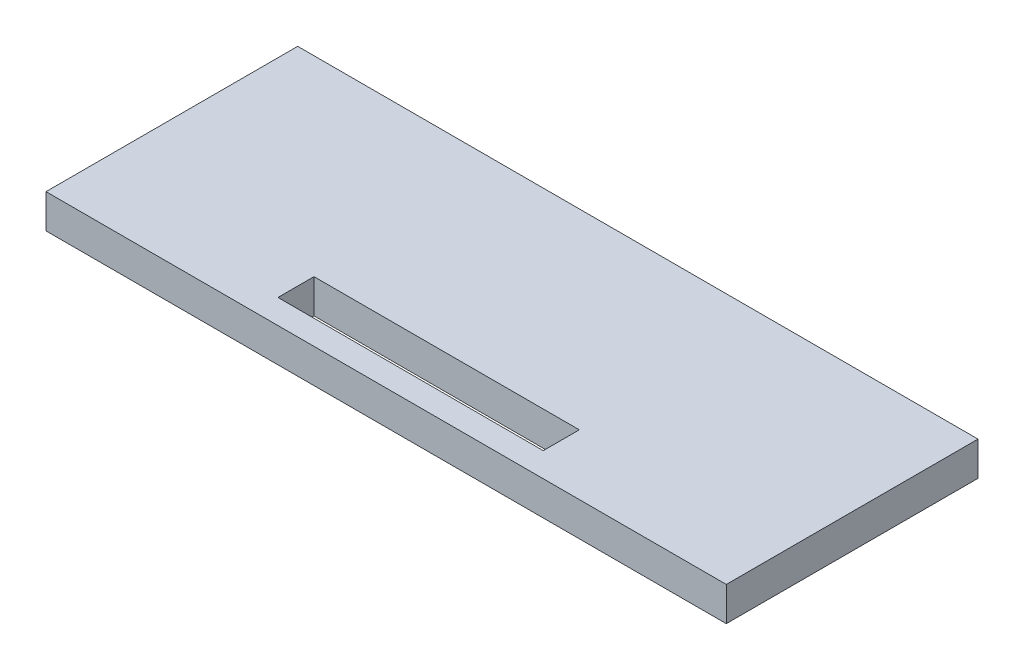
ISO-10303-21;
HEADER;
FILE_DESCRIPTION(('STEP AP214'),'2;1');
FILE_NAME('part.step','',(''),(''),'','','');
FILE_SCHEMA(('AUTOMOTIVE_DESIGN { 1 0 10303 214 1 1 1 1 }'));
ENDSEC;
DATA;
#1=APPLICATION_CONTEXT('core data for automotive mechanical design processes');
#2=APPLICATION_PROTOCOL_DEFINITION('international standard','automotive_design',2000,#1);
#3=PRODUCT_CONTEXT('',#1,'mechanical');
#4=PRODUCT('Part','Part','',(#3));
#5=PRODUCT_RELATED_PRODUCT_CATEGORY('part','',(#4));
#6=PRODUCT_DEFINITION_FORMATION('','',#4);
#7=PRODUCT_DEFINITION_CONTEXT('part definition',#1,'design');
#8=PRODUCT_DEFINITION('design','',#6,#7);
#9=PRODUCT_DEFINITION_SHAPE('','',#8);
#10=(LENGTH_UNIT() NAMED_UNIT(*) SI_UNIT(.MILLI.,.METRE.));
#11=(NAMED_UNIT(*) PLANE_ANGLE_UNIT() SI_UNIT($,.RADIAN.));
#12=(NAMED_UNIT(*) SI_UNIT($,.STERADIAN.) SOLID_ANGLE_UNIT());
#13=UNCERTAINTY_MEASURE_WITH_UNIT(LENGTH_MEASURE(1.E-05),#10,'distance_accuracy_value','');
#14=(GEOMETRIC_REPRESENTATION_CONTEXT(3) GLOBAL_UNCERTAINTY_ASSIGNED_CONTEXT((#13)) GLOBAL_UNIT_ASSIGNED_CONTEXT((#10,
#11,#12)) REPRESENTATION_CONTEXT('',''));
#15=CARTESIAN_POINT('',(0.,0.,0.));
#16=DIRECTION('',(0.,0.,1.));
#17=DIRECTION('',(1.,0.,0.));
#18=AXIS2_PLACEMENT_3D('',#15,#16,#17);
#19=CARTESIAN_POINT('',(0.,0.,0.));
#20=DIRECTION('',(0.,0.,-1.));
#21=DIRECTION('',(-1.,0.,0.));
#22=AXIS2_PLACEMENT_3D('',#19,#20,#21);
#23=PLANE('',#22);
#24=DIRECTION('',(-1.,0.,0.));
#25=VECTOR('',#24,1.);
#26=CARTESIAN_POINT('',(-50.0474551367422,-86.5025403784467,0.));
#27=LINE('',#26,#25);
#28=CARTESIAN_POINT('',(49.9525448632578,-86.5025403784467,0.));
#29=VERTEX_POINT('',#28);
#30=CARTESIAN_POINT('',(-50.0474551367422,-86.5025403784467,0.));
#31=VERTEX_POINT('',#30);
#32=EDGE_CURVE('E148',#29,#31,#27,.T.);
#33=ORIENTED_EDGE('',*,*,#32,.F.);
#34=DIRECTION('',(0.,1.,0.));
#35=VECTOR('',#34,1.);
#36=CARTESIAN_POINT('',(49.9525448632578,-86.5025403784467,0.));
#37=LINE('',#36,#35);
#38=CARTESIAN_POINT('',(49.9525448632578,-91.5025403784467,0.));
#39=VERTEX_POINT('',#38);
#40=EDGE_CURVE('E155',#39,#29,#37,.T.);
#41=ORIENTED_EDGE('',*,*,#40,.F.);
#42=DIRECTION('',(1.,0.,0.));
#43=VECTOR('',#42,1.);
#44=CARTESIAN_POINT('',(-50.0474551367422,-91.5025403784467,0.));
#45=LINE('',#44,#43);
#46=CARTESIAN_POINT('',(-50.0474551367422,-91.5025403784467,0.));
#47=VERTEX_POINT('',#46);
#48=EDGE_CURVE('E136',#47,#39,#45,.T.);
#49=ORIENTED_EDGE('',*,*,#48,.F.);
#50=DIRECTION('',(0.,-1.,0.));
#51=VECTOR('',#50,1.);
#52=CARTESIAN_POINT('',(-50.0474551367422,-90.5025403784467,0.));
#53=LINE('',#52,#51);
#54=EDGE_CURVE('E153',#31,#47,#53,.T.);
#55=ORIENTED_EDGE('',*,*,#54,.F.);
#56=EDGE_LOOP('',(#33,#41,#49,#55));
#57=FACE_BOUND('',#56,.T.);
#58=ADVANCED_FACE('F32',(#57),#23,.T.);
#59=CARTESIAN_POINT('',(49.9525448632578,-86.5025403784467,137.079968025574));
#60=DIRECTION('',(-1.,0.,0.));
#61=DIRECTION('',(0.,0.,1.));
#62=AXIS2_PLACEMENT_3D('',#59,#60,#61);
#63=PLANE('',#62);
#64=DIRECTION('',(0.,0.,-1.));
#65=VECTOR('',#64,1.);
#66=CARTESIAN_POINT('',(49.9525448632578,-86.5025403784467,137.079968025574));
#67=LINE('',#66,#65);
#68=CARTESIAN_POINT('',(49.9525448632578,-86.5025403784467,37.));
#69=VERTEX_POINT('',#68);
#70=EDGE_CURVE('E158',#69,#29,#67,.T.);
#71=ORIENTED_EDGE('',*,*,#70,.F.);
#72=DIRECTION('',(0.,-1.,0.));
#73=VECTOR('',#72,1.);
#74=CARTESIAN_POINT('',(49.9525448632578,-86.5025403784467,37.));
#75=LINE('',#74,#73);
#76=CARTESIAN_POINT('',(49.9525448632578,-91.5025403784467,37.));
#77=VERTEX_POINT('',#76);
#78=EDGE_CURVE('E36',#69,#77,#75,.T.);
#79=ORIENTED_EDGE('',*,*,#78,.T.);
#80=DIRECTION('',(0.,0.,1.));
#81=VECTOR('',#80,1.);
#82=CARTESIAN_POINT('',(49.9525448632578,-91.5025403784467,0.));
#83=LINE('',#82,#81);
#84=EDGE_CURVE('E139',#39,#77,#83,.T.);
#85=ORIENTED_EDGE('',*,*,#84,.F.);
#86=ORIENTED_EDGE('',*,*,#40,.T.);
#87=EDGE_LOOP('',(#71,#79,#85,#86));
#88=FACE_BOUND('',#87,.T.);
#89=ADVANCED_FACE('F166',(#88),#63,.F.);
#90=CARTESIAN_POINT('',(-50.0474551367422,-90.5025403784467,137.079968025574));
#91=DIRECTION('',(1.,0.,0.));
#92=DIRECTION('',(0.,0.,-1.));
#93=AXIS2_PLACEMENT_3D('',#90,#91,#92);
#94=PLANE('',#93);
#95=ORIENTED_EDGE('',*,*,#54,.T.);
#96=DIRECTION('',(0.,0.,-1.));
#97=VECTOR('',#96,1.);
#98=CARTESIAN_POINT('',(-50.0474551367422,-91.5025403784467,37.));
#99=LINE('',#98,#97);
#100=CARTESIAN_POINT('',(-50.0474551367422,-91.5025403784467,37.));
#101=VERTEX_POINT('',#100);
#102=EDGE_CURVE('E145',#101,#47,#99,.T.);
#103=ORIENTED_EDGE('',*,*,#102,.F.);
#104=DIRECTION('',(0.,1.,0.));
#105=VECTOR('',#104,1.);
#106=CARTESIAN_POINT('',(-50.0474551367422,-90.5025403784467,37.));
#107=LINE('',#106,#105);
#108=CARTESIAN_POINT('',(-50.0474551367422,-86.5025403784467,37.));
#109=VERTEX_POINT('',#108);
#110=EDGE_CURVE('E41',#101,#109,#107,.T.);
#111=ORIENTED_EDGE('',*,*,#110,.T.);
#112=DIRECTION('',(0.,0.,-1.));
#113=VECTOR('',#112,1.);
#114=CARTESIAN_POINT('',(-50.0474551367422,-86.5025403784467,137.079968025574));
#115=LINE('',#114,#113);
#116=EDGE_CURVE('E159',#109,#31,#115,.T.);
#117=ORIENTED_EDGE('',*,*,#116,.T.);
#118=EDGE_LOOP('',(#95,#103,#111,#117));
#119=FACE_BOUND('',#118,.T.);
#120=ADVANCED_FACE('F172',(#119),#94,.F.);
#121=CARTESIAN_POINT('',(-50.0474551367422,-86.5025403784467,137.079968025574));
#122=DIRECTION('',(0.,-1.,0.));
#123=DIRECTION('',(1.,0.,0.));
#124=AXIS2_PLACEMENT_3D('',#121,#122,#123);
#125=PLANE('',#124);
#126=DIRECTION('',(-1.,0.,0.));
#127=VECTOR('',#126,1.);
#128=CARTESIAN_POINT('',(-50.0474551367422,-86.5025403784467,33.4244095305818));
#129=LINE('',#128,#127);
#130=CARTESIAN_POINT('',(19.4696198935489,-86.5025403784467,33.4244095305818));
#131=VERTEX_POINT('',#130);
#132=CARTESIAN_POINT('',(-19.5303801064511,-86.5025403784467,33.4244095305818));
#133=VERTEX_POINT('',#132);
#134=EDGE_CURVE('E130',#131,#133,#129,.T.);
#135=ORIENTED_EDGE('',*,*,#134,.T.);
#136=DIRECTION('',(0.,0.,-1.));
#137=VECTOR('',#136,1.);
#138=CARTESIAN_POINT('',(-19.5303801064511,-86.5025403784467,137.079968025574));
#139=LINE('',#138,#137);
#140=CARTESIAN_POINT('',(-19.5303801064511,-86.5025403784467,28.1244095305818));
#141=VERTEX_POINT('',#140);
#142=EDGE_CURVE('E133',#133,#141,#139,.T.);
#143=ORIENTED_EDGE('',*,*,#142,.T.);
#144=DIRECTION('',(1.,0.,0.));
#145=VECTOR('',#144,1.);
#146=CARTESIAN_POINT('',(-50.0474551367422,-86.5025403784467,28.1244095305818));
#147=LINE('',#146,#145);
#148=CARTESIAN_POINT('',(19.4696198935489,-86.5025403784467,28.1244095305818));
#149=VERTEX_POINT('',#148);
#150=EDGE_CURVE('E125',#141,#149,#147,.T.);
#151=ORIENTED_EDGE('',*,*,#150,.T.);
#152=DIRECTION('',(0.,0.,-1.));
#153=VECTOR('',#152,1.);
#154=CARTESIAN_POINT('',(19.4696198935489,-86.5025403784467,137.079968025574));
#155=LINE('',#154,#153);
#156=EDGE_CURVE('E105',#131,#149,#155,.T.);
#157=ORIENTED_EDGE('',*,*,#156,.F.);
#158=EDGE_LOOP('',(#135,#143,#151,#157));
#159=FACE_BOUND('',#158,.T.);
#160=ORIENTED_EDGE('',*,*,#116,.F.);
#161=DIRECTION('',(1.,0.,0.));
#162=VECTOR('',#161,1.);
#163=CARTESIAN_POINT('',(-50.0474551367422,-86.5025403784467,37.));
#164=LINE('',#163,#162);
#165=EDGE_CURVE('E11',#109,#69,#164,.T.);
#166=ORIENTED_EDGE('',*,*,#165,.T.);
#167=ORIENTED_EDGE('',*,*,#70,.T.);
#168=ORIENTED_EDGE('',*,*,#32,.T.);
#169=EDGE_LOOP('',(#160,#166,#167,#168));
#170=FACE_BOUND('',#169,.T.);
#171=ADVANCED_FACE('F34',(#159,#170),#125,.F.);
#172=CARTESIAN_POINT('',(94.9985070964272,-0.000861896259243505,37.));
#173=DIRECTION('',(0.,0.,-1.));
#174=DIRECTION('',(-0.866025403784439,-0.5,0.));
#175=AXIS2_PLACEMENT_3D('',#172,#173,#174);
#176=PLANE('',#175);
#177=ORIENTED_EDGE('',*,*,#110,.F.);
#178=DIRECTION('',(-1.,0.,0.));
#179=VECTOR('',#178,1.);
#180=CARTESIAN_POINT('',(49.9525448632578,-91.5025403784467,37.));
#181=LINE('',#180,#179);
#182=EDGE_CURVE('E142',#77,#101,#181,.T.);
#183=ORIENTED_EDGE('',*,*,#182,.F.);
#184=ORIENTED_EDGE('',*,*,#78,.F.);
#185=ORIENTED_EDGE('',*,*,#165,.F.);
#186=EDGE_LOOP('',(#177,#183,#184,#185));
#187=FACE_BOUND('',#186,.T.);
#188=ADVANCED_FACE('F171',(#187),#176,.F.);
#189=CARTESIAN_POINT('',(0.,-91.5025403784467,0.));
#190=DIRECTION('',(0.,-1.,0.));
#191=DIRECTION('',(1.,0.,0.));
#192=AXIS2_PLACEMENT_3D('',#189,#190,#191);
#193=PLANE('',#192);
#194=DIRECTION('',(0.,0.,-1.));
#195=VECTOR('',#194,1.);
#196=CARTESIAN_POINT('',(-19.5303801064511,-91.5025403784467,33.4244095305818));
#197=LINE('',#196,#195);
#198=CARTESIAN_POINT('',(-19.5303801064511,-91.5025403784467,33.4244095305818));
#199=VERTEX_POINT('',#198);
#200=CARTESIAN_POINT('',(-19.5303801064511,-91.5025403784467,28.1244095305818));
#201=VERTEX_POINT('',#200);
#202=EDGE_CURVE('E57',#199,#201,#197,.T.);
#203=ORIENTED_EDGE('',*,*,#202,.F.);
#204=DIRECTION('',(-1.,0.,0.));
#205=VECTOR('',#204,1.);
#206=CARTESIAN_POINT('',(19.4696198935489,-91.5025403784467,33.4244095305818));
#207=LINE('',#206,#205);
#208=CARTESIAN_POINT('',(19.4696198935489,-91.5025403784467,33.4244095305818));
#209=VERTEX_POINT('',#208);
#210=EDGE_CURVE('E118',#209,#199,#207,.T.);
#211=ORIENTED_EDGE('',*,*,#210,.F.);
#212=DIRECTION('',(0.,0.,-1.));
#213=VECTOR('',#212,1.);
#214=CARTESIAN_POINT('',(19.4696198935489,-91.5025403784467,33.4244095305818));
#215=LINE('',#214,#213);
#216=CARTESIAN_POINT('',(19.4696198935489,-91.5025403784467,28.1244095305818));
#217=VERTEX_POINT('',#216);
#218=EDGE_CURVE('E102',#209,#217,#215,.T.);
#219=ORIENTED_EDGE('',*,*,#218,.T.);
#220=DIRECTION('',(1.,0.,0.));
#221=VECTOR('',#220,1.);
#222=CARTESIAN_POINT('',(-19.5303801064511,-91.5025403784467,28.1244095305818));
#223=LINE('',#222,#221);
#224=EDGE_CURVE('E111',#201,#217,#223,.T.);
#225=ORIENTED_EDGE('',*,*,#224,.F.);
#226=EDGE_LOOP('',(#203,#211,#219,#225));
#227=FACE_BOUND('',#226,.T.);
#228=ORIENTED_EDGE('',*,*,#48,.T.);
#229=ORIENTED_EDGE('',*,*,#84,.T.);
#230=ORIENTED_EDGE('',*,*,#182,.T.);
#231=ORIENTED_EDGE('',*,*,#102,.T.);
#232=EDGE_LOOP('',(#228,#229,#230,#231));
#233=FACE_BOUND('',#232,.T.);
#234=ADVANCED_FACE('F115',(#227,#233),#193,.T.);
#235=CARTESIAN_POINT('',(-19.5303801064511,-81.5025403784467,33.4244095305818));
#236=DIRECTION('',(-1.,0.,0.));
#237=DIRECTION('',(0.,-1.,0.));
#238=AXIS2_PLACEMENT_3D('',#235,#236,#237);
#239=PLANE('',#238);
#240=DIRECTION('',(0.,-1.,0.));
#241=VECTOR('',#240,1.);
#242=CARTESIAN_POINT('',(-19.5303801064511,-81.5025403784467,33.4244095305818));
#243=LINE('',#242,#241);
#244=EDGE_CURVE('E123',#133,#199,#243,.T.);
#245=ORIENTED_EDGE('',*,*,#244,.T.);
#246=ORIENTED_EDGE('',*,*,#202,.T.);
#247=DIRECTION('',(0.,-1.,0.));
#248=VECTOR('',#247,1.);
#249=CARTESIAN_POINT('',(-19.5303801064511,-81.5025403784467,28.1244095305818));
#250=LINE('',#249,#248);
#251=EDGE_CURVE('E108',#141,#201,#250,.T.);
#252=ORIENTED_EDGE('',*,*,#251,.F.);
#253=ORIENTED_EDGE('',*,*,#142,.F.);
#254=EDGE_LOOP('',(#245,#246,#252,#253));
#255=FACE_BOUND('',#254,.T.);
#256=ADVANCED_FACE('F192',(#255),#239,.F.);
#257=CARTESIAN_POINT('',(19.4696198935489,-81.5025403784467,33.4244095305818));
#258=DIRECTION('',(0.,0.,1.));
#259=DIRECTION('',(1.,0.,0.));
#260=AXIS2_PLACEMENT_3D('',#257,#258,#259);
#261=PLANE('',#260);
#262=DIRECTION('',(0.,-1.,0.));
#263=VECTOR('',#262,1.);
#264=CARTESIAN_POINT('',(19.4696198935489,-81.5025403784467,33.4244095305818));
#265=LINE('',#264,#263);
#266=EDGE_CURVE('E107',#131,#209,#265,.T.);
#267=ORIENTED_EDGE('',*,*,#266,.T.);
#268=ORIENTED_EDGE('',*,*,#210,.T.);
#269=ORIENTED_EDGE('',*,*,#244,.F.);
#270=ORIENTED_EDGE('',*,*,#134,.F.);
#271=EDGE_LOOP('',(#267,#268,#269,#270));
#272=FACE_BOUND('',#271,.T.);
#273=ADVANCED_FACE('F195',(#272),#261,.F.);
#274=CARTESIAN_POINT('',(19.4696198935489,-81.5025403784467,33.4244095305818));
#275=DIRECTION('',(-1.,0.,0.));
#276=DIRECTION('',(0.,-1.,0.));
#277=AXIS2_PLACEMENT_3D('',#274,#275,#276);
#278=PLANE('',#277);
#279=ORIENTED_EDGE('',*,*,#156,.T.);
#280=DIRECTION('',(0.,-1.,0.));
#281=VECTOR('',#280,1.);
#282=CARTESIAN_POINT('',(19.4696198935489,-81.5025403784467,28.1244095305818));
#283=LINE('',#282,#281);
#284=EDGE_CURVE('E49',#149,#217,#283,.T.);
#285=ORIENTED_EDGE('',*,*,#284,.T.);
#286=ORIENTED_EDGE('',*,*,#218,.F.);
#287=ORIENTED_EDGE('',*,*,#266,.F.);
#288=EDGE_LOOP('',(#279,#285,#286,#287));
#289=FACE_BOUND('',#288,.T.);
#290=ADVANCED_FACE('F99',(#289),#278,.T.);
#291=CARTESIAN_POINT('',(-19.5303801064511,-81.5025403784467,28.1244095305818));
#292=DIRECTION('',(0.,0.,-1.));
#293=DIRECTION('',(-1.,0.,0.));
#294=AXIS2_PLACEMENT_3D('',#291,#292,#293);
#295=PLANE('',#294);
#296=ORIENTED_EDGE('',*,*,#251,.T.);
#297=ORIENTED_EDGE('',*,*,#224,.T.);
#298=ORIENTED_EDGE('',*,*,#284,.F.);
#299=ORIENTED_EDGE('',*,*,#150,.F.);
#300=EDGE_LOOP('',(#296,#297,#298,#299));
#301=FACE_BOUND('',#300,.T.);
#302=ADVANCED_FACE('F112',(#301),#295,.F.);
#303=CLOSED_SHELL('',(#58,#89,#120,#171,#188,#234,#256,#273,#290,#302));
#304=MANIFOLD_SOLID_BREP('B2',#303);
#305=ADVANCED_BREP_SHAPE_REPRESENTATION('',(#18,#304),#14);
#306=SHAPE_DEFINITION_REPRESENTATION(#9,#305);
ENDSEC;
END-ISO-10303-21;
